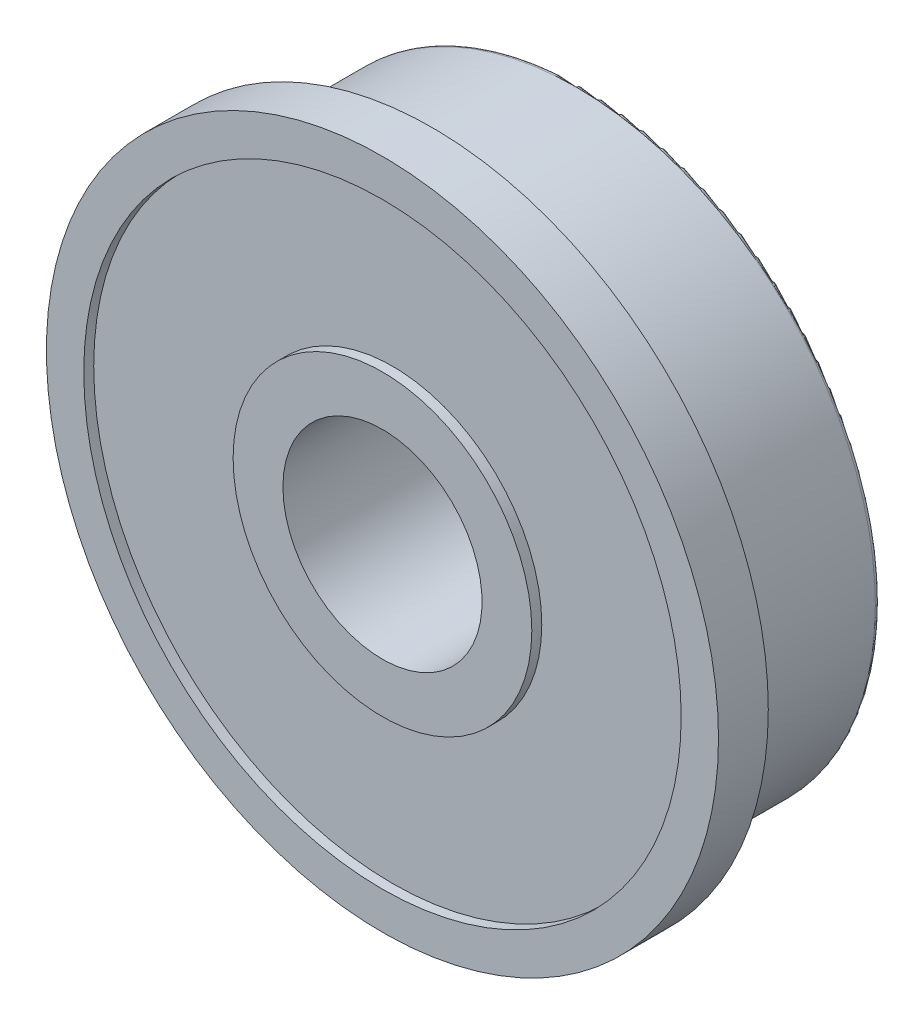
ISO-10303-21;
HEADER;
FILE_DESCRIPTION(('STEP AP214'),'2;1');
FILE_NAME('part.step','',(''),(''),'','','');
FILE_SCHEMA(('AUTOMOTIVE_DESIGN { 1 0 10303 214 1 1 1 1 }'));
ENDSEC;
DATA;
#1=APPLICATION_CONTEXT('core data for automotive mechanical design processes');
#2=APPLICATION_PROTOCOL_DEFINITION('international standard','automotive_design',2000,#1);
#3=PRODUCT_CONTEXT('',#1,'mechanical');
#4=PRODUCT('Part','Part','',(#3));
#5=PRODUCT_RELATED_PRODUCT_CATEGORY('part','',(#4));
#6=PRODUCT_DEFINITION_FORMATION('','',#4);
#7=PRODUCT_DEFINITION_CONTEXT('part definition',#1,'design');
#8=PRODUCT_DEFINITION('design','',#6,#7);
#9=PRODUCT_DEFINITION_SHAPE('','',#8);
#10=(LENGTH_UNIT() NAMED_UNIT(*) SI_UNIT(.MILLI.,.METRE.));
#11=(NAMED_UNIT(*) PLANE_ANGLE_UNIT() SI_UNIT($,.RADIAN.));
#12=(NAMED_UNIT(*) SI_UNIT($,.STERADIAN.) SOLID_ANGLE_UNIT());
#13=UNCERTAINTY_MEASURE_WITH_UNIT(LENGTH_MEASURE(1.E-05),#10,'distance_accuracy_value','');
#14=(GEOMETRIC_REPRESENTATION_CONTEXT(3) GLOBAL_UNCERTAINTY_ASSIGNED_CONTEXT((#13)) GLOBAL_UNIT_ASSIGNED_CONTEXT((#10,
#11,#12)) REPRESENTATION_CONTEXT('',''));
#15=CARTESIAN_POINT('',(0.,0.,0.));
#16=DIRECTION('',(0.,0.,1.));
#17=DIRECTION('',(1.,0.,0.));
#18=AXIS2_PLACEMENT_3D('',#15,#16,#17);
#19=CARTESIAN_POINT('',(0.,0.,4.));
#20=DIRECTION('',(0.,0.,1.));
#21=DIRECTION('',(1.,0.,0.));
#22=AXIS2_PLACEMENT_3D('',#19,#20,#21);
#23=PLANE('',#22);
#24=CARTESIAN_POINT('',(0.,0.,4.));
#25=DIRECTION('',(0.,0.,-1.));
#26=DIRECTION('',(-1.,0.,0.));
#27=AXIS2_PLACEMENT_3D('',#24,#25,#26);
#28=CIRCLE('',#27,2.);
#29=CARTESIAN_POINT('',(-2.,0.,4.));
#30=VERTEX_POINT('',#29);
#31=EDGE_CURVE('E55',#30,#30,#28,.T.);
#32=ORIENTED_EDGE('',*,*,#31,.T.);
#33=EDGE_LOOP('',(#32));
#34=FACE_BOUND('',#33,.T.);
#35=CARTESIAN_POINT('',(0.,0.,4.));
#36=DIRECTION('',(0.,0.,1.));
#37=DIRECTION('',(1.,0.,0.));
#38=AXIS2_PLACEMENT_3D('',#35,#36,#37);
#39=CIRCLE('',#38,3.);
#40=CARTESIAN_POINT('',(3.,0.,4.));
#41=VERTEX_POINT('',#40);
#42=EDGE_CURVE('E82',#41,#41,#39,.T.);
#43=ORIENTED_EDGE('',*,*,#42,.T.);
#44=EDGE_LOOP('',(#43));
#45=FACE_BOUND('',#44,.T.);
#46=ADVANCED_FACE('F34',(#34,#45),#23,.T.);
#47=CARTESIAN_POINT('',(0.,0.,0.));
#48=DIRECTION('',(0.,0.,1.));
#49=DIRECTION('',(1.,0.,0.));
#50=AXIS2_PLACEMENT_3D('',#47,#48,#49);
#51=PLANE('',#50);
#52=CARTESIAN_POINT('',(0.,0.,0.));
#53=DIRECTION('',(0.,0.,-1.));
#54=DIRECTION('',(-1.,0.,0.));
#55=AXIS2_PLACEMENT_3D('',#52,#53,#54);
#56=CIRCLE('',#55,2.);
#57=CARTESIAN_POINT('',(-2.,0.,0.));
#58=VERTEX_POINT('',#57);
#59=EDGE_CURVE('E58',#58,#58,#56,.T.);
#60=ORIENTED_EDGE('',*,*,#59,.F.);
#61=EDGE_LOOP('',(#60));
#62=FACE_BOUND('',#61,.T.);
#63=CARTESIAN_POINT('',(0.,0.,0.));
#64=DIRECTION('',(0.,0.,-1.));
#65=DIRECTION('',(-1.,0.,0.));
#66=AXIS2_PLACEMENT_3D('',#63,#64,#65);
#67=CIRCLE('',#66,3.);
#68=CARTESIAN_POINT('',(-3.,0.,0.));
#69=VERTEX_POINT('',#68);
#70=EDGE_CURVE('E70',#69,#69,#67,.T.);
#71=ORIENTED_EDGE('',*,*,#70,.T.);
#72=EDGE_LOOP('',(#71));
#73=FACE_BOUND('',#72,.T.);
#74=ADVANCED_FACE('F125',(#62,#73),#51,.F.);
#75=CARTESIAN_POINT('',(0.,0.,4.));
#76=DIRECTION('',(0.,0.,-1.));
#77=DIRECTION('',(-1.,0.,0.));
#78=AXIS2_PLACEMENT_3D('',#75,#76,#77);
#79=CYLINDRICAL_SURFACE('',#78,6.);
#80=CARTESIAN_POINT('',(0.,0.,0.0999999999999998));
#81=DIRECTION('',(0.,0.,1.));
#82=DIRECTION('',(1.,0.,0.));
#83=AXIS2_PLACEMENT_3D('',#80,#81,#82);
#84=CIRCLE('',#83,6.);
#85=CARTESIAN_POINT('',(6.,0.,0.0999999999999998));
#86=VERTEX_POINT('',#85);
#87=EDGE_CURVE('E41',#86,#86,#84,.T.);
#88=ORIENTED_EDGE('',*,*,#87,.T.);
#89=EDGE_LOOP('',(#88));
#90=FACE_BOUND('',#89,.T.);
#91=CARTESIAN_POINT('',(0.,0.,3.));
#92=DIRECTION('',(0.,0.,1.));
#93=DIRECTION('',(1.,0.,0.));
#94=AXIS2_PLACEMENT_3D('',#91,#92,#93);
#95=CIRCLE('',#94,6.);
#96=CARTESIAN_POINT('',(6.,0.,3.));
#97=VERTEX_POINT('',#96);
#98=EDGE_CURVE('E45',#97,#97,#95,.T.);
#99=ORIENTED_EDGE('',*,*,#98,.F.);
#100=EDGE_LOOP('',(#99));
#101=FACE_BOUND('',#100,.T.);
#102=ADVANCED_FACE('F123',(#90,#101),#79,.T.);
#103=CARTESIAN_POINT('',(0.,0.,0.));
#104=DIRECTION('',(0.,0.,1.));
#105=DIRECTION('',(1.,0.,0.));
#106=AXIS2_PLACEMENT_3D('',#103,#104,#105);
#107=CIRCLE('',#106,5.9);
#108=CARTESIAN_POINT('',(5.9,0.,0.));
#109=VERTEX_POINT('',#108);
#110=EDGE_CURVE('E10',#109,#109,#107,.F.);
#111=ORIENTED_EDGE('',*,*,#110,.T.);
#112=EDGE_LOOP('',(#111));
#113=FACE_BOUND('',#112,.T.);
#114=CARTESIAN_POINT('',(0.,0.,0.));
#115=DIRECTION('',(0.,0.,-1.));
#116=DIRECTION('',(-1.,0.,0.));
#117=AXIS2_PLACEMENT_3D('',#114,#115,#116);
#118=CIRCLE('',#117,5.);
#119=CARTESIAN_POINT('',(-5.,0.,0.));
#120=VERTEX_POINT('',#119);
#121=EDGE_CURVE('E64',#120,#120,#118,.T.);
#122=ORIENTED_EDGE('',*,*,#121,.F.);
#123=EDGE_LOOP('',(#122));
#124=FACE_BOUND('',#123,.T.);
#125=ADVANCED_FACE('F114',(#113,#124),#51,.F.);
#126=CARTESIAN_POINT('',(0.,0.,3.));
#127=DIRECTION('',(0.,0.,1.));
#128=DIRECTION('',(1.,0.,0.));
#129=AXIS2_PLACEMENT_3D('',#126,#127,#128);
#130=CYLINDRICAL_SURFACE('',#129,6.75);
#131=CARTESIAN_POINT('',(0.,0.,3.));
#132=DIRECTION('',(0.,0.,1.));
#133=DIRECTION('',(1.,0.,0.));
#134=AXIS2_PLACEMENT_3D('',#131,#132,#133);
#135=CIRCLE('',#134,6.75);
#136=CARTESIAN_POINT('',(6.75,0.,3.));
#137=VERTEX_POINT('',#136);
#138=EDGE_CURVE('E49',#137,#137,#135,.T.);
#139=ORIENTED_EDGE('',*,*,#138,.T.);
#140=EDGE_LOOP('',(#139));
#141=FACE_BOUND('',#140,.T.);
#142=CARTESIAN_POINT('',(0.,0.,4.));
#143=DIRECTION('',(0.,0.,1.));
#144=DIRECTION('',(1.,0.,0.));
#145=AXIS2_PLACEMENT_3D('',#142,#143,#144);
#146=CIRCLE('',#145,6.75);
#147=CARTESIAN_POINT('',(6.75,0.,4.));
#148=VERTEX_POINT('',#147);
#149=EDGE_CURVE('E52',#148,#148,#146,.T.);
#150=ORIENTED_EDGE('',*,*,#149,.F.);
#151=EDGE_LOOP('',(#150));
#152=FACE_BOUND('',#151,.T.);
#153=ADVANCED_FACE('F112',(#141,#152),#130,.T.);
#154=CARTESIAN_POINT('',(0.,0.,3.));
#155=DIRECTION('',(0.,0.,1.));
#156=DIRECTION('',(1.,0.,0.));
#157=AXIS2_PLACEMENT_3D('',#154,#155,#156);
#158=PLANE('',#157);
#159=ORIENTED_EDGE('',*,*,#98,.T.);
#160=EDGE_LOOP('',(#159));
#161=FACE_BOUND('',#160,.T.);
#162=ORIENTED_EDGE('',*,*,#138,.F.);
#163=EDGE_LOOP('',(#162));
#164=FACE_BOUND('',#163,.T.);
#165=ADVANCED_FACE('F108',(#161,#164),#158,.F.);
#166=CARTESIAN_POINT('',(0.,0.,4.));
#167=DIRECTION('',(0.,0.,1.));
#168=DIRECTION('',(1.,0.,0.));
#169=AXIS2_PLACEMENT_3D('',#166,#167,#168);
#170=CIRCLE('',#169,6.);
#171=CARTESIAN_POINT('',(6.,0.,4.));
#172=VERTEX_POINT('',#171);
#173=EDGE_CURVE('E76',#172,#172,#170,.T.);
#174=ORIENTED_EDGE('',*,*,#173,.F.);
#175=EDGE_LOOP('',(#174));
#176=FACE_BOUND('',#175,.T.);
#177=ORIENTED_EDGE('',*,*,#149,.T.);
#178=EDGE_LOOP('',(#177));
#179=FACE_BOUND('',#178,.T.);
#180=ADVANCED_FACE('F104',(#176,#179),#23,.T.);
#181=CARTESIAN_POINT('',(0.,0.,4.));
#182=DIRECTION('',(0.,0.,-1.));
#183=DIRECTION('',(-1.,0.,0.));
#184=AXIS2_PLACEMENT_3D('',#181,#182,#183);
#185=CYLINDRICAL_SURFACE('',#184,2.);
#186=ORIENTED_EDGE('',*,*,#31,.F.);
#187=EDGE_LOOP('',(#186));
#188=FACE_BOUND('',#187,.T.);
#189=ORIENTED_EDGE('',*,*,#59,.T.);
#190=EDGE_LOOP('',(#189));
#191=FACE_BOUND('',#190,.T.);
#192=ADVANCED_FACE('F107',(#188,#191),#185,.F.);
#193=CARTESIAN_POINT('',(0.,0.,0.2));
#194=DIRECTION('',(0.,0.,-1.));
#195=DIRECTION('',(-1.,0.,0.));
#196=AXIS2_PLACEMENT_3D('',#193,#194,#195);
#197=CYLINDRICAL_SURFACE('',#196,5.);
#198=CARTESIAN_POINT('',(0.,0.,0.2));
#199=DIRECTION('',(0.,0.,-1.));
#200=DIRECTION('',(-1.,0.,0.));
#201=AXIS2_PLACEMENT_3D('',#198,#199,#200);
#202=CIRCLE('',#201,5.);
#203=CARTESIAN_POINT('',(-5.,0.,0.2));
#204=VERTEX_POINT('',#203);
#205=EDGE_CURVE('E61',#204,#204,#202,.T.);
#206=ORIENTED_EDGE('',*,*,#205,.F.);
#207=EDGE_LOOP('',(#206));
#208=FACE_BOUND('',#207,.T.);
#209=ORIENTED_EDGE('',*,*,#121,.T.);
#210=EDGE_LOOP('',(#209));
#211=FACE_BOUND('',#210,.T.);
#212=ADVANCED_FACE('F187',(#208,#211),#197,.F.);
#213=CARTESIAN_POINT('',(0.,0.,0.2));
#214=DIRECTION('',(0.,0.,-1.));
#215=DIRECTION('',(-1.,0.,0.));
#216=AXIS2_PLACEMENT_3D('',#213,#214,#215);
#217=PLANE('',#216);
#218=CARTESIAN_POINT('',(0.,0.,0.2));
#219=DIRECTION('',(0.,0.,-1.));
#220=DIRECTION('',(-1.,0.,0.));
#221=AXIS2_PLACEMENT_3D('',#218,#219,#220);
#222=CIRCLE('',#221,3.);
#223=CARTESIAN_POINT('',(-3.,0.,0.2));
#224=VERTEX_POINT('',#223);
#225=EDGE_CURVE('E67',#224,#224,#222,.T.);
#226=ORIENTED_EDGE('',*,*,#225,.F.);
#227=EDGE_LOOP('',(#226));
#228=FACE_BOUND('',#227,.T.);
#229=ORIENTED_EDGE('',*,*,#205,.T.);
#230=EDGE_LOOP('',(#229));
#231=FACE_BOUND('',#230,.T.);
#232=ADVANCED_FACE('F179',(#228,#231),#217,.T.);
#233=CARTESIAN_POINT('',(0.,0.,0.2));
#234=DIRECTION('',(0.,0.,-1.));
#235=DIRECTION('',(-1.,0.,0.));
#236=AXIS2_PLACEMENT_3D('',#233,#234,#235);
#237=CYLINDRICAL_SURFACE('',#236,3.);
#238=ORIENTED_EDGE('',*,*,#225,.T.);
#239=EDGE_LOOP('',(#238));
#240=FACE_BOUND('',#239,.T.);
#241=ORIENTED_EDGE('',*,*,#70,.F.);
#242=EDGE_LOOP('',(#241));
#243=FACE_BOUND('',#242,.T.);
#244=ADVANCED_FACE('F100',(#240,#243),#237,.T.);
#245=CARTESIAN_POINT('',(0.,0.,3.8));
#246=DIRECTION('',(0.,0.,1.));
#247=DIRECTION('',(1.,0.,0.));
#248=AXIS2_PLACEMENT_3D('',#245,#246,#247);
#249=CYLINDRICAL_SURFACE('',#248,6.);
#250=CARTESIAN_POINT('',(0.,0.,3.8));
#251=DIRECTION('',(0.,0.,1.));
#252=DIRECTION('',(1.,0.,0.));
#253=AXIS2_PLACEMENT_3D('',#250,#251,#252);
#254=CIRCLE('',#253,6.);
#255=CARTESIAN_POINT('',(6.,0.,3.8));
#256=VERTEX_POINT('',#255);
#257=EDGE_CURVE('E73',#256,#256,#254,.T.);
#258=ORIENTED_EDGE('',*,*,#257,.F.);
#259=EDGE_LOOP('',(#258));
#260=FACE_BOUND('',#259,.T.);
#261=ORIENTED_EDGE('',*,*,#173,.T.);
#262=EDGE_LOOP('',(#261));
#263=FACE_BOUND('',#262,.T.);
#264=ADVANCED_FACE('F94',(#260,#263),#249,.F.);
#265=CARTESIAN_POINT('',(0.,0.,3.8));
#266=DIRECTION('',(0.,0.,1.));
#267=DIRECTION('',(1.,0.,0.));
#268=AXIS2_PLACEMENT_3D('',#265,#266,#267);
#269=PLANE('',#268);
#270=CARTESIAN_POINT('',(0.,0.,3.8));
#271=DIRECTION('',(0.,0.,1.));
#272=DIRECTION('',(1.,0.,0.));
#273=AXIS2_PLACEMENT_3D('',#270,#271,#272);
#274=CIRCLE('',#273,3.);
#275=CARTESIAN_POINT('',(3.,0.,3.8));
#276=VERTEX_POINT('',#275);
#277=EDGE_CURVE('E79',#276,#276,#274,.T.);
#278=ORIENTED_EDGE('',*,*,#277,.F.);
#279=EDGE_LOOP('',(#278));
#280=FACE_BOUND('',#279,.T.);
#281=ORIENTED_EDGE('',*,*,#257,.T.);
#282=EDGE_LOOP('',(#281));
#283=FACE_BOUND('',#282,.T.);
#284=ADVANCED_FACE('F91',(#280,#283),#269,.T.);
#285=CARTESIAN_POINT('',(0.,0.,3.8));
#286=DIRECTION('',(0.,0.,1.));
#287=DIRECTION('',(1.,0.,0.));
#288=AXIS2_PLACEMENT_3D('',#285,#286,#287);
#289=CYLINDRICAL_SURFACE('',#288,3.);
#290=ORIENTED_EDGE('',*,*,#277,.T.);
#291=EDGE_LOOP('',(#290));
#292=FACE_BOUND('',#291,.T.);
#293=ORIENTED_EDGE('',*,*,#42,.F.);
#294=EDGE_LOOP('',(#293));
#295=FACE_BOUND('',#294,.T.);
#296=ADVANCED_FACE('F88',(#292,#295),#289,.T.);
#297=CARTESIAN_POINT('',(0.,0.,0.0999999999999998));
#298=DIRECTION('',(0.,0.,1.));
#299=DIRECTION('',(1.,0.,0.));
#300=AXIS2_PLACEMENT_3D('',#297,#298,#299);
#301=TOROIDAL_SURFACE('',#300,5.9,0.1);
#302=ORIENTED_EDGE('',*,*,#110,.F.);
#303=EDGE_LOOP('',(#302));
#304=FACE_BOUND('',#303,.T.);
#305=ORIENTED_EDGE('',*,*,#87,.F.);
#306=EDGE_LOOP('',(#305));
#307=FACE_BOUND('',#306,.T.);
#308=ADVANCED_FACE('F36',(#304,#307),#301,.T.);
#309=CLOSED_SHELL('',(#46,#74,#102,#125,#153,#165,#180,#192,#212,#232,#244,#264,#284,#296,#308));
#310=MANIFOLD_SOLID_BREP('B2',#309);
#311=ADVANCED_BREP_SHAPE_REPRESENTATION('',(#18,#310),#14);
#312=SHAPE_DEFINITION_REPRESENTATION(#9,#311);
ENDSEC;
END-ISO-10303-21;
